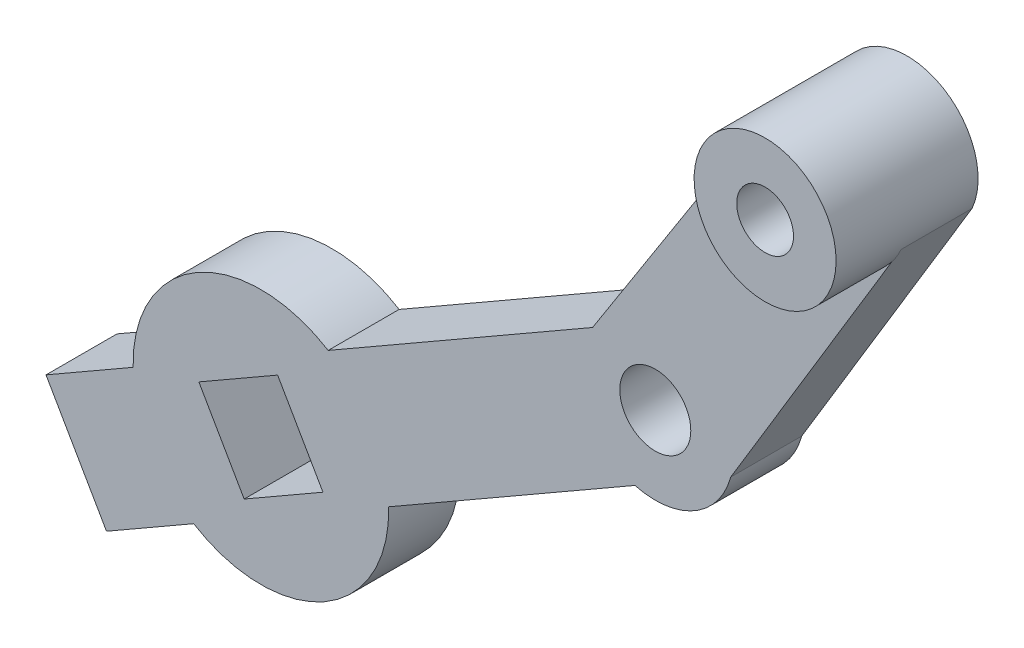
ISO-10303-21;
HEADER;
FILE_DESCRIPTION(('STEP AP214'),'2;1');
FILE_NAME('part.step','',(''),(''),'','','');
FILE_SCHEMA(('AUTOMOTIVE_DESIGN { 1 0 10303 214 1 1 1 1 }'));
ENDSEC;
DATA;
#1=APPLICATION_CONTEXT('core data for automotive mechanical design processes');
#2=APPLICATION_PROTOCOL_DEFINITION('international standard','automotive_design',2000,#1);
#3=PRODUCT_CONTEXT('',#1,'mechanical');
#4=PRODUCT('Part','Part','',(#3));
#5=PRODUCT_RELATED_PRODUCT_CATEGORY('part','',(#4));
#6=PRODUCT_DEFINITION_FORMATION('','',#4);
#7=PRODUCT_DEFINITION_CONTEXT('part definition',#1,'design');
#8=PRODUCT_DEFINITION('design','',#6,#7);
#9=PRODUCT_DEFINITION_SHAPE('','',#8);
#10=(LENGTH_UNIT() NAMED_UNIT(*) SI_UNIT(.MILLI.,.METRE.));
#11=(NAMED_UNIT(*) PLANE_ANGLE_UNIT() SI_UNIT($,.RADIAN.));
#12=(NAMED_UNIT(*) SI_UNIT($,.STERADIAN.) SOLID_ANGLE_UNIT());
#13=UNCERTAINTY_MEASURE_WITH_UNIT(LENGTH_MEASURE(1.E-05),#10,'distance_accuracy_value','');
#14=(GEOMETRIC_REPRESENTATION_CONTEXT(3) GLOBAL_UNCERTAINTY_ASSIGNED_CONTEXT((#13)) GLOBAL_UNIT_ASSIGNED_CONTEXT((#10,
#11,#12)) REPRESENTATION_CONTEXT('',''));
#15=CARTESIAN_POINT('',(0.,0.,0.));
#16=DIRECTION('',(0.,0.,1.));
#17=DIRECTION('',(1.,0.,0.));
#18=AXIS2_PLACEMENT_3D('',#15,#16,#17);
#19=CARTESIAN_POINT('',(0.17625658415401,-0.30648591573246,5.));
#20=DIRECTION('',(-0.498528903536302,0.866873077410351,0.));
#21=DIRECTION('',(-0.866873077410351,-0.498528903536302,0.));
#22=AXIS2_PLACEMENT_3D('',#19,#20,#21);
#23=PLANE('',#22);
#24=DIRECTION('',(0.,0.,1.));
#25=VECTOR('',#24,1.);
#26=CARTESIAN_POINT('',(-34.2898479293558,-20.1275528516411,-25.4558441227157));
#27=LINE('',#26,#25);
#28=CARTESIAN_POINT('',(-34.2898479293558,-20.1275528516411,0.));
#29=VERTEX_POINT('',#28);
#30=CARTESIAN_POINT('',(-34.2898479293558,-20.1275528516411,5.));
#31=VERTEX_POINT('',#30);
#32=EDGE_CURVE('E237',#29,#31,#27,.T.);
#33=ORIENTED_EDGE('',*,*,#32,.F.);
#34=DIRECTION('',(0.866873077410351,0.498528903536302,0.));
#35=VECTOR('',#34,1.);
#36=CARTESIAN_POINT('',(0.17625658415401,-0.30648591573246,0.));
#37=LINE('',#36,#35);
#38=CARTESIAN_POINT('',(-40.4263847840177,-23.6566057999731,0.));
#39=VERTEX_POINT('',#38);
#40=EDGE_CURVE('E256',#39,#29,#37,.T.);
#41=ORIENTED_EDGE('',*,*,#40,.F.);
#42=DIRECTION('',(0.,0.,-1.));
#43=VECTOR('',#42,1.);
#44=CARTESIAN_POINT('',(-40.4263847840177,-23.6566057999731,5.));
#45=LINE('',#44,#43);
#46=CARTESIAN_POINT('',(-40.4263847840177,-23.6566057999731,5.));
#47=VERTEX_POINT('',#46);
#48=EDGE_CURVE('E47',#47,#39,#45,.T.);
#49=ORIENTED_EDGE('',*,*,#48,.F.);
#50=DIRECTION('',(0.866873077410351,0.498528903536302,0.));
#51=VECTOR('',#50,1.);
#52=CARTESIAN_POINT('',(0.17625658415401,-0.30648591573246,5.));
#53=LINE('',#52,#51);
#54=EDGE_CURVE('E240',#47,#31,#53,.T.);
#55=ORIENTED_EDGE('',*,*,#54,.T.);
#56=EDGE_LOOP('',(#33,#41,#49,#55));
#57=FACE_BOUND('',#56,.T.);
#58=ADVANCED_FACE('F39',(#57),#23,.T.);
#59=CARTESIAN_POINT('',(4.43647181358803,-7.71441323985198,5.));
#60=DIRECTION('',(-0.498528903536302,0.866873077410351,0.));
#61=DIRECTION('',(-0.866873077410351,-0.498528903536302,0.));
#62=AXIS2_PLACEMENT_3D('',#59,#60,#61);
#63=PLANE('',#62);
#64=DIRECTION('',(0.866873077410351,0.498528903536302,0.));
#65=VECTOR('',#64,1.);
#66=CARTESIAN_POINT('',(4.43647181358803,-7.71441323985198,0.));
#67=LINE('',#66,#65);
#68=CARTESIAN_POINT('',(-36.1661695545836,-31.0645331240926,0.));
#69=VERTEX_POINT('',#68);
#70=CARTESIAN_POINT('',(-30.0296326999218,-27.5354801757606,0.));
#71=VERTEX_POINT('',#70);
#72=EDGE_CURVE('E262',#69,#71,#67,.T.);
#73=ORIENTED_EDGE('',*,*,#72,.T.);
#74=DIRECTION('',(0.,0.,1.));
#75=VECTOR('',#74,1.);
#76=CARTESIAN_POINT('',(-30.0296326999218,-27.5354801757606,-25.4558441227157));
#77=LINE('',#76,#75);
#78=CARTESIAN_POINT('',(-30.0296326999218,-27.5354801757606,5.));
#79=VERTEX_POINT('',#78);
#80=EDGE_CURVE('E232',#71,#79,#77,.T.);
#81=ORIENTED_EDGE('',*,*,#80,.T.);
#82=DIRECTION('',(0.866873077410351,0.498528903536302,0.));
#83=VECTOR('',#82,1.);
#84=CARTESIAN_POINT('',(4.43647181358803,-7.71441323985198,5.));
#85=LINE('',#84,#83);
#86=CARTESIAN_POINT('',(-36.1661695545836,-31.0645331240926,5.));
#87=VERTEX_POINT('',#86);
#88=EDGE_CURVE('E246',#87,#79,#85,.T.);
#89=ORIENTED_EDGE('',*,*,#88,.F.);
#90=DIRECTION('',(0.,0.,-1.));
#91=VECTOR('',#90,1.);
#92=CARTESIAN_POINT('',(-36.1661695545836,-31.0645331240926,5.));
#93=LINE('',#92,#91);
#94=EDGE_CURVE('E281',#87,#69,#93,.T.);
#95=ORIENTED_EDGE('',*,*,#94,.T.);
#96=EDGE_LOOP('',(#73,#81,#89,#95));
#97=FACE_BOUND('',#96,.T.);
#98=ADVANCED_FACE('F323',(#97),#63,.F.);
#99=CARTESIAN_POINT('',(-0.682703439514869,0.436635830889686,5.));
#100=DIRECTION('',(-0.842436284988127,0.538795977838925,0.));
#101=DIRECTION('',(-0.538795977838925,-0.842436284988127,0.));
#102=AXIS2_PLACEMENT_3D('',#99,#100,#101);
#103=PLANE('',#102);
#104=DIRECTION('',(0.538795977838925,0.842436284988127,0.));
#105=VECTOR('',#104,1.);
#106=CARTESIAN_POINT('',(-0.682703439514869,0.436635830889686,0.));
#107=LINE('',#106,#105);
#108=CARTESIAN_POINT('',(-1.93424021867878,-1.52020875988425,0.));
#109=VERTEX_POINT('',#108);
#110=CARTESIAN_POINT('',(10.6400793801503,18.1404114466345,0.));
#111=VERTEX_POINT('',#110);
#112=EDGE_CURVE('E238',#109,#111,#107,.T.);
#113=ORIENTED_EDGE('',*,*,#112,.F.);
#114=DIRECTION('',(0.,0.,-1.));
#115=VECTOR('',#114,1.);
#116=CARTESIAN_POINT('',(-1.93424021867878,-1.52020875988425,5.));
#117=LINE('',#116,#115);
#118=CARTESIAN_POINT('',(-1.93424021867878,-1.52020875988425,5.));
#119=VERTEX_POINT('',#118);
#120=EDGE_CURVE('E11',#119,#109,#117,.T.);
#121=ORIENTED_EDGE('',*,*,#120,.F.);
#122=DIRECTION('',(0.538795977838925,0.842436284988127,0.));
#123=VECTOR('',#122,1.);
#124=CARTESIAN_POINT('',(-0.682703439514869,0.436635830889686,5.));
#125=LINE('',#124,#123);
#126=CARTESIAN_POINT('',(10.6400793801503,18.1404114466345,5.));
#127=VERTEX_POINT('',#126);
#128=EDGE_CURVE('E150',#119,#127,#125,.T.);
#129=ORIENTED_EDGE('',*,*,#128,.T.);
#130=DIRECTION('',(0.,0.,-1.));
#131=VECTOR('',#130,1.);
#132=CARTESIAN_POINT('',(10.6400793801503,18.1404114466345,5.));
#133=LINE('',#132,#131);
#134=EDGE_CURVE('E153',#127,#111,#133,.T.);
#135=ORIENTED_EDGE('',*,*,#134,.T.);
#136=EDGE_LOOP('',(#113,#121,#129,#135));
#137=FACE_BOUND('',#136,.T.);
#138=ADVANCED_FACE('F41',(#137),#103,.T.);
#139=DIRECTION('',(0.,0.,1.));
#140=VECTOR('',#139,1.);
#141=CARTESIAN_POINT('',(-20.556729316369,-12.2297916422161,-25.4558441227157));
#142=LINE('',#141,#140);
#143=CARTESIAN_POINT('',(-20.556729316369,-12.2297916422161,5.));
#144=VERTEX_POINT('',#143);
#145=CARTESIAN_POINT('',(-20.556729316369,-12.2297916422161,0.));
#146=VERTEX_POINT('',#145);
#147=EDGE_CURVE('E234',#144,#146,#142,.F.);
#148=ORIENTED_EDGE('',*,*,#147,.F.);
#149=EDGE_CURVE('E158',#144,#119,#53,.T.);
#150=ORIENTED_EDGE('',*,*,#149,.T.);
#151=ORIENTED_EDGE('',*,*,#120,.T.);
#152=EDGE_CURVE('E255',#146,#109,#37,.T.);
#153=ORIENTED_EDGE('',*,*,#152,.F.);
#154=EDGE_LOOP('',(#148,#150,#151,#153));
#155=FACE_BOUND('',#154,.T.);
#156=ADVANCED_FACE('F301',(#155),#23,.T.);
#157=CARTESIAN_POINT('',(-40.6026413681717,-23.3501198842406,5.));
#158=DIRECTION('',(0.866873077410351,0.498528903536302,0.));
#159=DIRECTION('',(-0.498528903536302,0.866873077410351,0.));
#160=AXIS2_PLACEMENT_3D('',#157,#158,#159);
#161=PLANE('',#160);
#162=DIRECTION('',(0.498528903536302,-0.866873077410351,0.));
#163=VECTOR('',#162,1.);
#164=CARTESIAN_POINT('',(-40.6026413681717,-23.3501198842406,0.));
#165=LINE('',#164,#163);
#166=EDGE_CURVE('E259',#39,#69,#165,.T.);
#167=ORIENTED_EDGE('',*,*,#166,.T.);
#168=ORIENTED_EDGE('',*,*,#94,.F.);
#169=DIRECTION('',(0.498528903536302,-0.866873077410351,0.));
#170=VECTOR('',#169,1.);
#171=CARTESIAN_POINT('',(-40.6026413681717,-23.3501198842406,5.));
#172=LINE('',#171,#170);
#173=EDGE_CURVE('E243',#47,#87,#172,.T.);
#174=ORIENTED_EDGE('',*,*,#173,.F.);
#175=ORIENTED_EDGE('',*,*,#48,.T.);
#176=EDGE_LOOP('',(#167,#168,#174,#175));
#177=FACE_BOUND('',#176,.T.);
#178=ADVANCED_FACE('F286',(#177),#161,.F.);
#179=CARTESIAN_POINT('',(-16.296514086935,-19.6377189663356,5.));
#180=VERTEX_POINT('',#179);
#181=CARTESIAN_POINT('',(1.04782478556533,-9.66318582418271,5.));
#182=VERTEX_POINT('',#181);
#183=EDGE_CURVE('E245',#180,#182,#85,.T.);
#184=ORIENTED_EDGE('',*,*,#183,.F.);
#185=DIRECTION('',(0.,0.,1.));
#186=VECTOR('',#185,1.);
#187=CARTESIAN_POINT('',(-16.296514086935,-19.6377189663356,-25.4558441227157));
#188=LINE('',#187,#186);
#189=CARTESIAN_POINT('',(-16.296514086935,-19.6377189663356,0.));
#190=VERTEX_POINT('',#189);
#191=EDGE_CURVE('E229',#180,#190,#188,.F.);
#192=ORIENTED_EDGE('',*,*,#191,.T.);
#193=CARTESIAN_POINT('',(1.04782478556533,-9.66318582418271,0.));
#194=VERTEX_POINT('',#193);
#195=EDGE_CURVE('E261',#190,#194,#67,.T.);
#196=ORIENTED_EDGE('',*,*,#195,.T.);
#197=DIRECTION('',(0.,0.,-1.));
#198=VECTOR('',#197,1.);
#199=CARTESIAN_POINT('',(1.04782478556533,-9.66318582418271,5.));
#200=LINE('',#199,#198);
#201=EDGE_CURVE('E278',#182,#194,#200,.T.);
#202=ORIENTED_EDGE('',*,*,#201,.F.);
#203=EDGE_LOOP('',(#184,#192,#196,#202));
#204=FACE_BOUND('',#203,.T.);
#205=ADVANCED_FACE('F329',(#204),#63,.F.);
#206=CARTESIAN_POINT('',(2.48034743292827,-4.35301832543163,5.));
#207=DIRECTION('',(0.,0.,-1.));
#208=DIRECTION('',(-1.,0.,0.));
#209=AXIS2_PLACEMENT_3D('',#206,#207,#208);
#210=CYLINDRICAL_SURFACE('',#209,5.5);
#211=CARTESIAN_POINT('',(2.48034743292827,-4.35301832543163,0.));
#212=DIRECTION('',(0.,0.,1.));
#213=DIRECTION('',(1.,0.,0.));
#214=AXIS2_PLACEMENT_3D('',#211,#212,#213);
#215=CIRCLE('',#214,5.5);
#216=CARTESIAN_POINT('',(7.79051493167935,-5.78554097279456,0.));
#217=VERTEX_POINT('',#216);
#218=EDGE_CURVE('E264',#194,#217,#215,.T.);
#219=ORIENTED_EDGE('',*,*,#218,.T.);
#220=DIRECTION('',(0.,0.,-1.));
#221=VECTOR('',#220,1.);
#222=CARTESIAN_POINT('',(7.79051493167935,-5.78554097279456,5.));
#223=LINE('',#222,#221);
#224=CARTESIAN_POINT('',(7.79051493167935,-5.78554097279456,5.));
#225=VERTEX_POINT('',#224);
#226=EDGE_CURVE('E275',#225,#217,#223,.T.);
#227=ORIENTED_EDGE('',*,*,#226,.F.);
#228=CARTESIAN_POINT('',(2.48034743292827,-4.35301832543163,5.));
#229=DIRECTION('',(0.,0.,1.));
#230=DIRECTION('',(1.,0.,0.));
#231=AXIS2_PLACEMENT_3D('',#228,#229,#230);
#232=CIRCLE('',#231,5.5);
#233=EDGE_CURVE('E249',#182,#225,#232,.T.);
#234=ORIENTED_EDGE('',*,*,#233,.F.);
#235=ORIENTED_EDGE('',*,*,#201,.T.);
#236=EDGE_LOOP('',(#219,#227,#234,#235));
#237=FACE_BOUND('',#236,.T.);
#238=ADVANCED_FACE('F362',(#237),#210,.T.);
#239=CARTESIAN_POINT('',(8.27057905312399,-4.98984292672802,5.));
#240=DIRECTION('',(-0.856234541670631,0.51658727205583,0.));
#241=DIRECTION('',(-0.51658727205583,-0.856234541670632,0.));
#242=AXIS2_PLACEMENT_3D('',#239,#240,#241);
#243=PLANE('',#242);
#244=DIRECTION('',(0.51658727205583,0.856234541670631,0.));
#245=VECTOR('',#244,1.);
#246=CARTESIAN_POINT('',(8.27057905312399,-4.98984292672802,0.));
#247=LINE('',#246,#245);
#248=CARTESIAN_POINT('',(19.7862245967424,14.097142017446,0.));
#249=VERTEX_POINT('',#248);
#250=EDGE_CURVE('E266',#217,#249,#247,.T.);
#251=ORIENTED_EDGE('',*,*,#250,.T.);
#252=DIRECTION('',(0.,0.,-1.));
#253=VECTOR('',#252,1.);
#254=CARTESIAN_POINT('',(19.7862245967424,14.097142017446,5.));
#255=LINE('',#254,#253);
#256=CARTESIAN_POINT('',(19.7862245967424,14.097142017446,5.));
#257=VERTEX_POINT('',#256);
#258=EDGE_CURVE('E171',#257,#249,#255,.T.);
#259=ORIENTED_EDGE('',*,*,#258,.F.);
#260=DIRECTION('',(0.51658727205583,0.856234541670631,0.));
#261=VECTOR('',#260,1.);
#262=CARTESIAN_POINT('',(8.27057905312399,-4.98984292672802,5.));
#263=LINE('',#262,#261);
#264=CARTESIAN_POINT('',(19.1338806378452,13.0158930961649,5.));
#265=VERTEX_POINT('',#264);
#266=EDGE_CURVE('E54',#265,#257,#263,.T.);
#267=ORIENTED_EDGE('',*,*,#266,.F.);
#268=EDGE_CURVE('E176',#225,#265,#263,.T.);
#269=ORIENTED_EDGE('',*,*,#268,.F.);
#270=ORIENTED_EDGE('',*,*,#226,.T.);
#271=EDGE_LOOP('',(#251,#259,#267,#269,#270));
#272=FACE_BOUND('',#271,.T.);
#273=ADVANCED_FACE('F305',(#272),#243,.F.);
#274=CARTESIAN_POINT('',(15.2131519884464,16.1187767320402,5.));
#275=DIRECTION('',(0.,0.,-1.));
#276=DIRECTION('',(-1.,0.,0.));
#277=AXIS2_PLACEMENT_3D('',#274,#275,#276);
#278=CYLINDRICAL_SURFACE('',#277,2.);
#279=CARTESIAN_POINT('',(15.2131519884464,16.1187767320402,0.));
#280=DIRECTION('',(0.,0.,1.));
#281=DIRECTION('',(1.,0.,0.));
#282=AXIS2_PLACEMENT_3D('',#279,#280,#281);
#283=CIRCLE('',#282,2.);
#284=CARTESIAN_POINT('',(17.2131519884464,16.1187767320402,0.));
#285=VERTEX_POINT('',#284);
#286=EDGE_CURVE('E269',#285,#285,#283,.T.);
#287=ORIENTED_EDGE('',*,*,#286,.F.);
#288=EDGE_LOOP('',(#287));
#289=FACE_BOUND('',#288,.T.);
#290=CARTESIAN_POINT('',(15.2131519884464,16.1187767320402,10.));
#291=DIRECTION('',(0.,0.,1.));
#292=DIRECTION('',(1.,0.,0.));
#293=AXIS2_PLACEMENT_3D('',#290,#291,#292);
#294=CIRCLE('',#293,2.);
#295=CARTESIAN_POINT('',(17.2131519884464,16.1187767320402,10.));
#296=VERTEX_POINT('',#295);
#297=EDGE_CURVE('E184',#296,#296,#294,.T.);
#298=ORIENTED_EDGE('',*,*,#297,.T.);
#299=EDGE_LOOP('',(#298));
#300=FACE_BOUND('',#299,.T.);
#301=ADVANCED_FACE('F456',(#289,#300),#278,.F.);
#302=CARTESIAN_POINT('',(15.2131519884464,16.1187767320402,5.));
#303=DIRECTION('',(0.,0.,-1.));
#304=DIRECTION('',(-1.,0.,0.));
#305=AXIS2_PLACEMENT_3D('',#302,#303,#304);
#306=CYLINDRICAL_SURFACE('',#305,5.);
#307=CARTESIAN_POINT('',(15.2131519884464,16.1187767320402,0.));
#308=DIRECTION('',(0.,0.,1.));
#309=DIRECTION('',(1.,0.,0.));
#310=AXIS2_PLACEMENT_3D('',#307,#308,#309);
#311=CIRCLE('',#310,5.);
#312=EDGE_CURVE('E169',#249,#111,#311,.T.);
#313=ORIENTED_EDGE('',*,*,#312,.T.);
#314=ORIENTED_EDGE('',*,*,#134,.F.);
#315=CARTESIAN_POINT('',(15.2131519884464,16.1187767320402,5.));
#316=DIRECTION('',(0.,0.,1.));
#317=DIRECTION('',(1.,0.,0.));
#318=AXIS2_PLACEMENT_3D('',#315,#316,#317);
#319=CIRCLE('',#318,5.);
#320=EDGE_CURVE('E166',#127,#265,#319,.T.);
#321=ORIENTED_EDGE('',*,*,#320,.T.);
#322=EDGE_CURVE('E179',#265,#257,#319,.T.);
#323=ORIENTED_EDGE('',*,*,#322,.T.);
#324=ORIENTED_EDGE('',*,*,#258,.T.);
#325=EDGE_LOOP('',(#313,#314,#321,#323,#324));
#326=FACE_BOUND('',#325,.T.);
#327=CARTESIAN_POINT('',(15.2131519884464,16.1187767320402,10.));
#328=DIRECTION('',(0.,0.,1.));
#329=DIRECTION('',(1.,0.,0.));
#330=AXIS2_PLACEMENT_3D('',#327,#328,#329);
#331=CIRCLE('',#330,5.);
#332=CARTESIAN_POINT('',(20.2131519884464,16.1187767320402,10.));
#333=VERTEX_POINT('',#332);
#334=EDGE_CURVE('E178',#333,#333,#331,.T.);
#335=ORIENTED_EDGE('',*,*,#334,.F.);
#336=EDGE_LOOP('',(#335));
#337=FACE_BOUND('',#336,.T.);
#338=ADVANCED_FACE('F163',(#326,#337),#306,.T.);
#339=CARTESIAN_POINT('',(2.48034743292827,-4.35301832543163,5.));
#340=DIRECTION('',(0.,0.,-1.));
#341=DIRECTION('',(-1.,0.,0.));
#342=AXIS2_PLACEMENT_3D('',#339,#340,#341);
#343=CYLINDRICAL_SURFACE('',#342,2.5);
#344=CARTESIAN_POINT('',(2.48034743292827,-4.35301832543163,5.));
#345=DIRECTION('',(0.,0.,1.));
#346=DIRECTION('',(1.,0.,0.));
#347=AXIS2_PLACEMENT_3D('',#344,#345,#346);
#348=CIRCLE('',#347,2.5);
#349=CARTESIAN_POINT('',(4.98034743292827,-4.35301832543163,5.));
#350=VERTEX_POINT('',#349);
#351=EDGE_CURVE('E172',#350,#350,#348,.T.);
#352=ORIENTED_EDGE('',*,*,#351,.T.);
#353=EDGE_LOOP('',(#352));
#354=FACE_BOUND('',#353,.T.);
#355=CARTESIAN_POINT('',(2.48034743292827,-4.35301832543163,0.));
#356=DIRECTION('',(0.,0.,1.));
#357=DIRECTION('',(1.,0.,0.));
#358=AXIS2_PLACEMENT_3D('',#355,#356,#357);
#359=CIRCLE('',#358,2.5);
#360=CARTESIAN_POINT('',(4.98034743292827,-4.35301832543163,0.));
#361=VERTEX_POINT('',#360);
#362=EDGE_CURVE('E159',#361,#361,#359,.T.);
#363=ORIENTED_EDGE('',*,*,#362,.F.);
#364=EDGE_LOOP('',(#363));
#365=FACE_BOUND('',#364,.T.);
#366=ADVANCED_FACE('F474',(#354,#365),#343,.F.);
#367=CARTESIAN_POINT('',(0.,0.,5.));
#368=DIRECTION('',(0.,0.,1.));
#369=DIRECTION('',(1.,0.,0.));
#370=AXIS2_PLACEMENT_3D('',#367,#368,#369);
#371=PLANE('',#370);
#372=ORIENTED_EDGE('',*,*,#320,.F.);
#373=ORIENTED_EDGE('',*,*,#128,.F.);
#374=ORIENTED_EDGE('',*,*,#149,.F.);
#375=CARTESIAN_POINT('',(-25.2931810081454,-19.8826359089883,5.));
#376=DIRECTION('',(0.,0.,1.));
#377=DIRECTION('',(1.,0.,0.));
#378=AXIS2_PLACEMENT_3D('',#375,#376,#377);
#379=CIRCLE('',#378,9.);
#380=EDGE_CURVE('E224',#144,#31,#379,.T.);
#381=ORIENTED_EDGE('',*,*,#380,.T.);
#382=ORIENTED_EDGE('',*,*,#54,.F.);
#383=ORIENTED_EDGE('',*,*,#173,.T.);
#384=ORIENTED_EDGE('',*,*,#88,.T.);
#385=EDGE_CURVE('E221',#79,#180,#379,.T.);
#386=ORIENTED_EDGE('',*,*,#385,.T.);
#387=ORIENTED_EDGE('',*,*,#183,.T.);
#388=ORIENTED_EDGE('',*,*,#233,.T.);
#389=ORIENTED_EDGE('',*,*,#268,.T.);
#390=EDGE_LOOP('',(#372,#373,#374,#381,#382,#383,#384,#386,#387,#388,#389));
#391=FACE_BOUND('',#390,.T.);
#392=DIRECTION('',(0.866873077410351,0.498528903536302,0.));
#393=VECTOR('',#392,1.);
#394=CARTESIAN_POINT('',(-20.9238946691161,-21.0613372653853,5.));
#395=LINE('',#394,#393);
#396=CARTESIAN_POINT('',(-26.4718823645424,-24.2519222480176,5.));
#397=VERTEX_POINT('',#396);
#398=CARTESIAN_POINT('',(-20.9238946691161,-21.0613372653853,5.));
#399=VERTEX_POINT('',#398);
#400=EDGE_CURVE('E62',#397,#399,#395,.T.);
#401=ORIENTED_EDGE('',*,*,#400,.F.);
#402=DIRECTION('',(0.498528903536302,-0.866873077410351,0.));
#403=VECTOR('',#402,1.);
#404=CARTESIAN_POINT('',(-26.4718823645424,-24.2519222480176,5.));
#405=LINE('',#404,#403);
#406=CARTESIAN_POINT('',(-29.6624673471747,-18.7039345525914,5.));
#407=VERTEX_POINT('',#406);
#408=EDGE_CURVE('E207',#407,#397,#405,.T.);
#409=ORIENTED_EDGE('',*,*,#408,.F.);
#410=DIRECTION('',(-0.866873077410351,-0.498528903536302,0.));
#411=VECTOR('',#410,1.);
#412=CARTESIAN_POINT('',(-24.1144796517484,-15.5133495699591,5.));
#413=LINE('',#412,#411);
#414=CARTESIAN_POINT('',(-24.1144796517484,-15.5133495699591,5.));
#415=VERTEX_POINT('',#414);
#416=EDGE_CURVE('E204',#415,#407,#413,.T.);
#417=ORIENTED_EDGE('',*,*,#416,.F.);
#418=DIRECTION('',(-0.498528903536302,0.866873077410351,0.));
#419=VECTOR('',#418,1.);
#420=CARTESIAN_POINT('',(-20.9238946691161,-21.0613372653853,5.));
#421=LINE('',#420,#419);
#422=EDGE_CURVE('E201',#399,#415,#421,.T.);
#423=ORIENTED_EDGE('',*,*,#422,.F.);
#424=EDGE_LOOP('',(#401,#409,#417,#423));
#425=FACE_BOUND('',#424,.T.);
#426=ORIENTED_EDGE('',*,*,#351,.F.);
#427=EDGE_LOOP('',(#426));
#428=FACE_BOUND('',#427,.T.);
#429=ADVANCED_FACE('F174',(#391,#425,#428),#371,.T.);
#430=CARTESIAN_POINT('',(0.,0.,0.));
#431=DIRECTION('',(0.,0.,1.));
#432=DIRECTION('',(1.,0.,0.));
#433=AXIS2_PLACEMENT_3D('',#430,#431,#432);
#434=PLANE('',#433);
#435=DIRECTION('',(-0.498528903536302,0.866873077410351,0.));
#436=VECTOR('',#435,1.);
#437=CARTESIAN_POINT('',(-26.4718823645424,-24.2519222480176,0.));
#438=LINE('',#437,#436);
#439=CARTESIAN_POINT('',(-26.4718823645424,-24.2519222480176,0.));
#440=VERTEX_POINT('',#439);
#441=CARTESIAN_POINT('',(-29.6624673471747,-18.7039345525914,0.));
#442=VERTEX_POINT('',#441);
#443=EDGE_CURVE('E194',#440,#442,#438,.T.);
#444=ORIENTED_EDGE('',*,*,#443,.F.);
#445=DIRECTION('',(-0.866873077410351,-0.498528903536302,0.));
#446=VECTOR('',#445,1.);
#447=CARTESIAN_POINT('',(-20.9238946691161,-21.0613372653853,0.));
#448=LINE('',#447,#446);
#449=CARTESIAN_POINT('',(-20.9238946691161,-21.0613372653853,0.));
#450=VERTEX_POINT('',#449);
#451=EDGE_CURVE('E197',#450,#440,#448,.T.);
#452=ORIENTED_EDGE('',*,*,#451,.F.);
#453=DIRECTION('',(0.498528903536302,-0.866873077410351,0.));
#454=VECTOR('',#453,1.);
#455=CARTESIAN_POINT('',(-20.9238946691161,-21.0613372653853,0.));
#456=LINE('',#455,#454);
#457=CARTESIAN_POINT('',(-24.1144796517484,-15.5133495699591,0.));
#458=VERTEX_POINT('',#457);
#459=EDGE_CURVE('E213',#458,#450,#456,.T.);
#460=ORIENTED_EDGE('',*,*,#459,.F.);
#461=DIRECTION('',(0.866873077410351,0.498528903536302,0.));
#462=VECTOR('',#461,1.);
#463=CARTESIAN_POINT('',(-24.1144796517484,-15.5133495699591,0.));
#464=LINE('',#463,#462);
#465=EDGE_CURVE('E190',#442,#458,#464,.T.);
#466=ORIENTED_EDGE('',*,*,#465,.F.);
#467=EDGE_LOOP('',(#444,#452,#460,#466));
#468=FACE_BOUND('',#467,.T.);
#469=ORIENTED_EDGE('',*,*,#40,.T.);
#470=CARTESIAN_POINT('',(-25.2931810081454,-19.8826359089883,0.));
#471=DIRECTION('',(0.,0.,1.));
#472=DIRECTION('',(1.,0.,0.));
#473=AXIS2_PLACEMENT_3D('',#470,#471,#472);
#474=CIRCLE('',#473,9.);
#475=EDGE_CURVE('E228',#29,#146,#474,.F.);
#476=ORIENTED_EDGE('',*,*,#475,.T.);
#477=ORIENTED_EDGE('',*,*,#152,.T.);
#478=ORIENTED_EDGE('',*,*,#112,.T.);
#479=ORIENTED_EDGE('',*,*,#312,.F.);
#480=ORIENTED_EDGE('',*,*,#250,.F.);
#481=ORIENTED_EDGE('',*,*,#218,.F.);
#482=ORIENTED_EDGE('',*,*,#195,.F.);
#483=EDGE_CURVE('E225',#190,#71,#474,.F.);
#484=ORIENTED_EDGE('',*,*,#483,.T.);
#485=ORIENTED_EDGE('',*,*,#72,.F.);
#486=ORIENTED_EDGE('',*,*,#166,.F.);
#487=EDGE_LOOP('',(#469,#476,#477,#478,#479,#480,#481,#482,#484,#485,#486));
#488=FACE_BOUND('',#487,.T.);
#489=ORIENTED_EDGE('',*,*,#362,.T.);
#490=EDGE_LOOP('',(#489));
#491=FACE_BOUND('',#490,.T.);
#492=ORIENTED_EDGE('',*,*,#286,.T.);
#493=EDGE_LOOP('',(#492));
#494=FACE_BOUND('',#493,.T.);
#495=ADVANCED_FACE('F293',(#468,#488,#491,#494),#434,.F.);
#496=CARTESIAN_POINT('',(-25.2931810081454,-19.8826359089883,-25.4558441227157));
#497=DIRECTION('',(0.,0.,1.));
#498=DIRECTION('',(1.,0.,0.));
#499=AXIS2_PLACEMENT_3D('',#496,#497,#498);
#500=CYLINDRICAL_SURFACE('',#499,9.);
#501=ORIENTED_EDGE('',*,*,#80,.F.);
#502=ORIENTED_EDGE('',*,*,#483,.F.);
#503=ORIENTED_EDGE('',*,*,#191,.F.);
#504=ORIENTED_EDGE('',*,*,#385,.F.);
#505=EDGE_LOOP('',(#501,#502,#503,#504));
#506=FACE_BOUND('',#505,.T.);
#507=ADVANCED_FACE('F369',(#506),#500,.T.);
#508=ORIENTED_EDGE('',*,*,#475,.F.);
#509=ORIENTED_EDGE('',*,*,#32,.T.);
#510=ORIENTED_EDGE('',*,*,#380,.F.);
#511=ORIENTED_EDGE('',*,*,#147,.T.);
#512=EDGE_LOOP('',(#508,#509,#510,#511));
#513=FACE_BOUND('',#512,.T.);
#514=ADVANCED_FACE('F298',(#513),#500,.T.);
#515=CARTESIAN_POINT('',(-20.9238946691161,-21.0613372653853,-0.00100000000000013));
#516=DIRECTION('',(0.498528903536302,-0.866873077410351,0.));
#517=DIRECTION('',(0.866873077410351,0.498528903536302,0.));
#518=AXIS2_PLACEMENT_3D('',#515,#516,#517);
#519=PLANE('',#518);
#520=ORIENTED_EDGE('',*,*,#451,.T.);
#521=DIRECTION('',(0.,0.,1.));
#522=VECTOR('',#521,1.);
#523=CARTESIAN_POINT('',(-26.4718823645424,-24.2519222480176,-0.00100000000000013));
#524=LINE('',#523,#522);
#525=EDGE_CURVE('E211',#440,#397,#524,.T.);
#526=ORIENTED_EDGE('',*,*,#525,.T.);
#527=ORIENTED_EDGE('',*,*,#400,.T.);
#528=DIRECTION('',(0.,0.,1.));
#529=VECTOR('',#528,1.);
#530=CARTESIAN_POINT('',(-20.9238946691161,-21.0613372653853,-0.00100000000000013));
#531=LINE('',#530,#529);
#532=EDGE_CURVE('E210',#450,#399,#531,.T.);
#533=ORIENTED_EDGE('',*,*,#532,.F.);
#534=EDGE_LOOP('',(#520,#526,#527,#533));
#535=FACE_BOUND('',#534,.T.);
#536=ADVANCED_FACE('F385',(#535),#519,.F.);
#537=CARTESIAN_POINT('',(-26.4718823645424,-24.2519222480176,-0.00100000000000013));
#538=DIRECTION('',(-0.866873077410351,-0.498528903536302,0.));
#539=DIRECTION('',(0.498528903536302,-0.866873077410351,0.));
#540=AXIS2_PLACEMENT_3D('',#537,#538,#539);
#541=PLANE('',#540);
#542=ORIENTED_EDGE('',*,*,#443,.T.);
#543=DIRECTION('',(0.,0.,1.));
#544=VECTOR('',#543,1.);
#545=CARTESIAN_POINT('',(-29.6624673471747,-18.7039345525914,-0.00100000000000013));
#546=LINE('',#545,#544);
#547=EDGE_CURVE('E214',#442,#407,#546,.T.);
#548=ORIENTED_EDGE('',*,*,#547,.T.);
#549=ORIENTED_EDGE('',*,*,#408,.T.);
#550=ORIENTED_EDGE('',*,*,#525,.F.);
#551=EDGE_LOOP('',(#542,#548,#549,#550));
#552=FACE_BOUND('',#551,.T.);
#553=ADVANCED_FACE('F402',(#552),#541,.F.);
#554=CARTESIAN_POINT('',(-24.1144796517484,-15.5133495699591,-0.00100000000000013));
#555=DIRECTION('',(-0.498528903536302,0.866873077410351,0.));
#556=DIRECTION('',(-0.866873077410351,-0.498528903536302,0.));
#557=AXIS2_PLACEMENT_3D('',#554,#555,#556);
#558=PLANE('',#557);
#559=ORIENTED_EDGE('',*,*,#465,.T.);
#560=DIRECTION('',(0.,0.,1.));
#561=VECTOR('',#560,1.);
#562=CARTESIAN_POINT('',(-24.1144796517484,-15.5133495699591,-0.00100000000000013));
#563=LINE('',#562,#561);
#564=EDGE_CURVE('E216',#458,#415,#563,.T.);
#565=ORIENTED_EDGE('',*,*,#564,.T.);
#566=ORIENTED_EDGE('',*,*,#416,.T.);
#567=ORIENTED_EDGE('',*,*,#547,.F.);
#568=EDGE_LOOP('',(#559,#565,#566,#567));
#569=FACE_BOUND('',#568,.T.);
#570=ADVANCED_FACE('F411',(#569),#558,.F.);
#571=CARTESIAN_POINT('',(-20.9238946691161,-21.0613372653853,-0.00100000000000013));
#572=DIRECTION('',(0.866873077410351,0.498528903536302,0.));
#573=DIRECTION('',(-0.498528903536302,0.866873077410351,0.));
#574=AXIS2_PLACEMENT_3D('',#571,#572,#573);
#575=PLANE('',#574);
#576=CARTESIAN_POINT('',(-22.5191871604323,-18.2873434176722,2.5));
#577=DIRECTION('',(-0.866873077410351,-0.498528903536302,0.));
#578=DIRECTION('',(0.498528903536302,-0.866873077410351,0.));
#579=AXIS2_PLACEMENT_3D('',#576,#577,#578);
#580=CIRCLE('',#579,1.);
#581=CARTESIAN_POINT('',(-22.020658256896,-19.1542164950825,2.5));
#582=VERTEX_POINT('',#581);
#583=EDGE_CURVE('E182',#582,#582,#580,.T.);
#584=ORIENTED_EDGE('',*,*,#583,.F.);
#585=EDGE_LOOP('',(#584));
#586=FACE_BOUND('',#585,.T.);
#587=ORIENTED_EDGE('',*,*,#459,.T.);
#588=ORIENTED_EDGE('',*,*,#532,.T.);
#589=ORIENTED_EDGE('',*,*,#422,.T.);
#590=ORIENTED_EDGE('',*,*,#564,.F.);
#591=EDGE_LOOP('',(#587,#588,#589,#590));
#592=FACE_BOUND('',#591,.T.);
#593=ADVANCED_FACE('F421',(#586,#592),#575,.F.);
#594=CARTESIAN_POINT('',(-22.0857506217271,-18.038078965904,2.5));
#595=DIRECTION('',(-0.866873077410351,-0.498528903536302,0.));
#596=DIRECTION('',(0.498528903536302,-0.866873077410351,0.));
#597=AXIS2_PLACEMENT_3D('',#594,#595,#596);
#598=CYLINDRICAL_SURFACE('',#597,1.);
#599=CARTESIAN_POINT('',(-22.0857506217271,-18.038078965904,2.5));
#600=DIRECTION('',(-0.866873077410351,-0.498528903536302,0.));
#601=DIRECTION('',(0.498528903536302,-0.866873077410351,0.));
#602=AXIS2_PLACEMENT_3D('',#599,#600,#601);
#603=CIRCLE('',#602,1.);
#604=CARTESIAN_POINT('',(-21.5872217181908,-18.9049520433144,2.5));
#605=VERTEX_POINT('',#604);
#606=EDGE_CURVE('E187',#605,#605,#603,.T.);
#607=ORIENTED_EDGE('',*,*,#606,.F.);
#608=EDGE_LOOP('',(#607));
#609=FACE_BOUND('',#608,.T.);
#610=ORIENTED_EDGE('',*,*,#583,.T.);
#611=EDGE_LOOP('',(#610));
#612=FACE_BOUND('',#611,.T.);
#613=ADVANCED_FACE('F319',(#609,#612),#598,.F.);
#614=CARTESIAN_POINT('',(-22.0857506217271,-18.038078965904,2.5));
#615=DIRECTION('',(-0.866873077410351,-0.498528903536302,0.));
#616=DIRECTION('',(0.498528903536302,-0.866873077410351,0.));
#617=AXIS2_PLACEMENT_3D('',#614,#615,#616);
#618=PLANE('',#617);
#619=ORIENTED_EDGE('',*,*,#606,.T.);
#620=EDGE_LOOP('',(#619));
#621=FACE_BOUND('',#620,.T.);
#622=ADVANCED_FACE('F311',(#621),#618,.T.);
#623=CARTESIAN_POINT('',(15.2131519884464,16.1187767320402,5.));
#624=DIRECTION('',(0.,0.,1.));
#625=DIRECTION('',(1.,0.,0.));
#626=AXIS2_PLACEMENT_3D('',#623,#624,#625);
#627=PLANE('',#626);
#628=ORIENTED_EDGE('',*,*,#322,.F.);
#629=ORIENTED_EDGE('',*,*,#266,.T.);
#630=EDGE_LOOP('',(#628,#629));
#631=FACE_BOUND('',#630,.T.);
#632=ADVANCED_FACE('F308',(#631),#627,.F.);
#633=CARTESIAN_POINT('',(15.2131519884464,16.1187767320402,10.));
#634=DIRECTION('',(0.,0.,1.));
#635=DIRECTION('',(1.,0.,0.));
#636=AXIS2_PLACEMENT_3D('',#633,#634,#635);
#637=PLANE('',#636);
#638=ORIENTED_EDGE('',*,*,#334,.T.);
#639=EDGE_LOOP('',(#638));
#640=FACE_BOUND('',#639,.T.);
#641=ORIENTED_EDGE('',*,*,#297,.F.);
#642=EDGE_LOOP('',(#641));
#643=FACE_BOUND('',#642,.T.);
#644=ADVANCED_FACE('F310',(#640,#643),#637,.T.);
#645=CLOSED_SHELL('',(#58,#98,#138,#156,#178,#205,#238,#273,#301,#338,#366,#429,#495,#507,#514,
#536,#553,#570,#593,#613,#622,#632,#644));
#646=MANIFOLD_SOLID_BREP('B2',#645);
#647=ADVANCED_BREP_SHAPE_REPRESENTATION('',(#18,#646),#14);
#648=SHAPE_DEFINITION_REPRESENTATION(#9,#647);
ENDSEC;
END-ISO-10303-21;
